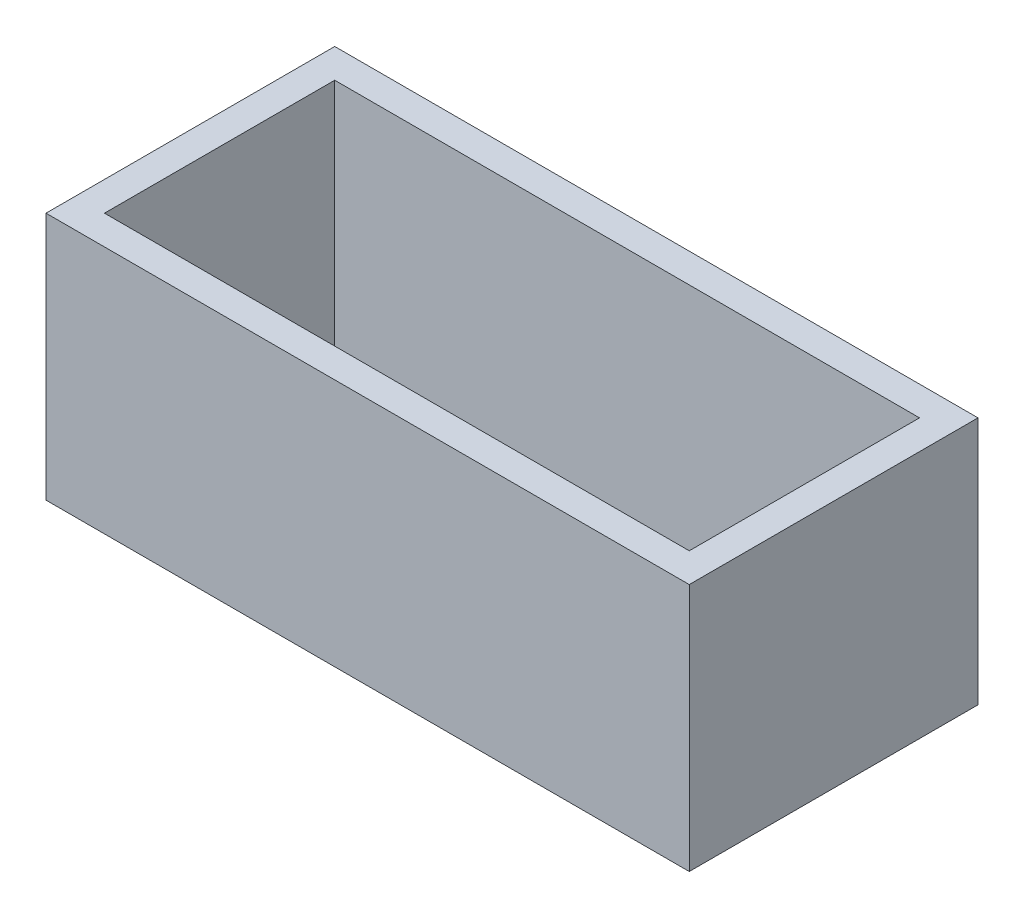
ISO-10303-21;
HEADER;
FILE_DESCRIPTION(('STEP AP214'),'2;1');
FILE_NAME('part.step','',(''),(''),'','','');
FILE_SCHEMA(('AUTOMOTIVE_DESIGN { 1 0 10303 214 1 1 1 1 }'));
ENDSEC;
DATA;
#1=APPLICATION_CONTEXT('core data for automotive mechanical design processes');
#2=APPLICATION_PROTOCOL_DEFINITION('international standard','automotive_design',2000,#1);
#3=PRODUCT_CONTEXT('',#1,'mechanical');
#4=PRODUCT('Part','Part','',(#3));
#5=PRODUCT_RELATED_PRODUCT_CATEGORY('part','',(#4));
#6=PRODUCT_DEFINITION_FORMATION('','',#4);
#7=PRODUCT_DEFINITION_CONTEXT('part definition',#1,'design');
#8=PRODUCT_DEFINITION('design','',#6,#7);
#9=PRODUCT_DEFINITION_SHAPE('','',#8);
#10=(LENGTH_UNIT() NAMED_UNIT(*) SI_UNIT(.MILLI.,.METRE.));
#11=(NAMED_UNIT(*) PLANE_ANGLE_UNIT() SI_UNIT($,.RADIAN.));
#12=(NAMED_UNIT(*) SI_UNIT($,.STERADIAN.) SOLID_ANGLE_UNIT());
#13=UNCERTAINTY_MEASURE_WITH_UNIT(LENGTH_MEASURE(1.E-05),#10,'distance_accuracy_value','');
#14=(GEOMETRIC_REPRESENTATION_CONTEXT(3) GLOBAL_UNCERTAINTY_ASSIGNED_CONTEXT((#13)) GLOBAL_UNIT_ASSIGNED_CONTEXT((#10,
#11,#12)) REPRESENTATION_CONTEXT('',''));
#15=CARTESIAN_POINT('',(0.,0.,0.));
#16=DIRECTION('',(0.,0.,1.));
#17=DIRECTION('',(1.,0.,0.));
#18=AXIS2_PLACEMENT_3D('',#15,#16,#17);
#19=CARTESIAN_POINT('',(0.,17.,0.));
#20=DIRECTION('',(0.,1.,0.));
#21=DIRECTION('',(0.,0.,1.));
#22=AXIS2_PLACEMENT_3D('',#19,#20,#21);
#23=PLANE('',#22);
#24=DIRECTION('',(0.,0.,-1.));
#25=VECTOR('',#24,1.);
#26=CARTESIAN_POINT('',(22.,17.,9.875));
#27=LINE('',#26,#25);
#28=CARTESIAN_POINT('',(22.,17.,9.875));
#29=VERTEX_POINT('',#28);
#30=CARTESIAN_POINT('',(22.,17.,-9.875));
#31=VERTEX_POINT('',#30);
#32=EDGE_CURVE('E134',#29,#31,#27,.T.);
#33=ORIENTED_EDGE('',*,*,#32,.T.);
#34=DIRECTION('',(-1.,0.,0.));
#35=VECTOR('',#34,1.);
#36=CARTESIAN_POINT('',(22.,17.,-9.875));
#37=LINE('',#36,#35);
#38=CARTESIAN_POINT('',(-22.,17.,-9.875));
#39=VERTEX_POINT('',#38);
#40=EDGE_CURVE('E137',#31,#39,#37,.T.);
#41=ORIENTED_EDGE('',*,*,#40,.T.);
#42=DIRECTION('',(0.,0.,1.));
#43=VECTOR('',#42,1.);
#44=CARTESIAN_POINT('',(-22.,17.,9.875));
#45=LINE('',#44,#43);
#46=CARTESIAN_POINT('',(-22.,17.,9.875));
#47=VERTEX_POINT('',#46);
#48=EDGE_CURVE('E140',#39,#47,#45,.T.);
#49=ORIENTED_EDGE('',*,*,#48,.T.);
#50=DIRECTION('',(1.,0.,0.));
#51=VECTOR('',#50,1.);
#52=CARTESIAN_POINT('',(22.,17.,9.875));
#53=LINE('',#52,#51);
#54=EDGE_CURVE('E142',#47,#29,#53,.T.);
#55=ORIENTED_EDGE('',*,*,#54,.T.);
#56=EDGE_LOOP('',(#33,#41,#49,#55));
#57=FACE_BOUND('',#56,.T.);
#58=DIRECTION('',(1.,0.,0.));
#59=VECTOR('',#58,1.);
#60=CARTESIAN_POINT('',(20.,17.,7.875));
#61=LINE('',#60,#59);
#62=CARTESIAN_POINT('',(-20.,17.,7.875));
#63=VERTEX_POINT('',#62);
#64=CARTESIAN_POINT('',(20.,17.,7.875));
#65=VERTEX_POINT('',#64);
#66=EDGE_CURVE('E106',#63,#65,#61,.T.);
#67=ORIENTED_EDGE('',*,*,#66,.F.);
#68=DIRECTION('',(0.,0.,1.));
#69=VECTOR('',#68,1.);
#70=CARTESIAN_POINT('',(-20.,17.,7.875));
#71=LINE('',#70,#69);
#72=CARTESIAN_POINT('',(-20.,17.,-7.875));
#73=VERTEX_POINT('',#72);
#74=EDGE_CURVE('E98',#73,#63,#71,.T.);
#75=ORIENTED_EDGE('',*,*,#74,.F.);
#76=DIRECTION('',(-1.,0.,0.));
#77=VECTOR('',#76,1.);
#78=CARTESIAN_POINT('',(20.,17.,-7.875));
#79=LINE('',#78,#77);
#80=CARTESIAN_POINT('',(20.,17.,-7.875));
#81=VERTEX_POINT('',#80);
#82=EDGE_CURVE('E120',#81,#73,#79,.T.);
#83=ORIENTED_EDGE('',*,*,#82,.F.);
#84=DIRECTION('',(0.,0.,-1.));
#85=VECTOR('',#84,1.);
#86=CARTESIAN_POINT('',(20.,17.,7.875));
#87=LINE('',#86,#85);
#88=EDGE_CURVE('E118',#65,#81,#87,.T.);
#89=ORIENTED_EDGE('',*,*,#88,.F.);
#90=EDGE_LOOP('',(#67,#75,#83,#89));
#91=FACE_BOUND('',#90,.T.);
#92=ADVANCED_FACE('F33',(#57,#91),#23,.T.);
#93=CARTESIAN_POINT('',(0.,0.,0.));
#94=DIRECTION('',(0.,1.,0.));
#95=DIRECTION('',(0.,0.,1.));
#96=AXIS2_PLACEMENT_3D('',#93,#94,#95);
#97=PLANE('',#96);
#98=DIRECTION('',(0.,0.,-1.));
#99=VECTOR('',#98,1.);
#100=CARTESIAN_POINT('',(22.,0.,9.875));
#101=LINE('',#100,#99);
#102=CARTESIAN_POINT('',(22.,0.,9.875));
#103=VERTEX_POINT('',#102);
#104=CARTESIAN_POINT('',(22.,0.,-9.875));
#105=VERTEX_POINT('',#104);
#106=EDGE_CURVE('E114',#103,#105,#101,.T.);
#107=ORIENTED_EDGE('',*,*,#106,.F.);
#108=DIRECTION('',(1.,0.,0.));
#109=VECTOR('',#108,1.);
#110=CARTESIAN_POINT('',(22.,0.,9.875));
#111=LINE('',#110,#109);
#112=CARTESIAN_POINT('',(-22.,0.,9.875));
#113=VERTEX_POINT('',#112);
#114=EDGE_CURVE('E138',#113,#103,#111,.T.);
#115=ORIENTED_EDGE('',*,*,#114,.F.);
#116=DIRECTION('',(0.,0.,1.));
#117=VECTOR('',#116,1.);
#118=CARTESIAN_POINT('',(-22.,0.,9.875));
#119=LINE('',#118,#117);
#120=CARTESIAN_POINT('',(-22.,0.,-9.875));
#121=VERTEX_POINT('',#120);
#122=EDGE_CURVE('E149',#121,#113,#119,.T.);
#123=ORIENTED_EDGE('',*,*,#122,.F.);
#124=DIRECTION('',(-1.,0.,0.));
#125=VECTOR('',#124,1.);
#126=CARTESIAN_POINT('',(22.,0.,-9.875));
#127=LINE('',#126,#125);
#128=EDGE_CURVE('E147',#105,#121,#127,.T.);
#129=ORIENTED_EDGE('',*,*,#128,.F.);
#130=EDGE_LOOP('',(#107,#115,#123,#129));
#131=FACE_BOUND('',#130,.T.);
#132=DIRECTION('',(0.,0.,1.));
#133=VECTOR('',#132,1.);
#134=CARTESIAN_POINT('',(-20.,0.,7.875));
#135=LINE('',#134,#133);
#136=CARTESIAN_POINT('',(-20.,0.,-7.875));
#137=VERTEX_POINT('',#136);
#138=CARTESIAN_POINT('',(-20.,0.,7.875));
#139=VERTEX_POINT('',#138);
#140=EDGE_CURVE('E56',#137,#139,#135,.T.);
#141=ORIENTED_EDGE('',*,*,#140,.T.);
#142=DIRECTION('',(1.,0.,0.));
#143=VECTOR('',#142,1.);
#144=CARTESIAN_POINT('',(20.,0.,7.875));
#145=LINE('',#144,#143);
#146=CARTESIAN_POINT('',(20.,0.,7.875));
#147=VERTEX_POINT('',#146);
#148=EDGE_CURVE('E113',#139,#147,#145,.T.);
#149=ORIENTED_EDGE('',*,*,#148,.T.);
#150=DIRECTION('',(0.,0.,-1.));
#151=VECTOR('',#150,1.);
#152=CARTESIAN_POINT('',(20.,0.,7.875));
#153=LINE('',#152,#151);
#154=CARTESIAN_POINT('',(20.,0.,-7.875));
#155=VERTEX_POINT('',#154);
#156=EDGE_CURVE('E126',#147,#155,#153,.T.);
#157=ORIENTED_EDGE('',*,*,#156,.T.);
#158=DIRECTION('',(-1.,0.,0.));
#159=VECTOR('',#158,1.);
#160=CARTESIAN_POINT('',(20.,0.,-7.875));
#161=LINE('',#160,#159);
#162=EDGE_CURVE('E107',#155,#137,#161,.T.);
#163=ORIENTED_EDGE('',*,*,#162,.T.);
#164=EDGE_LOOP('',(#141,#149,#157,#163));
#165=FACE_BOUND('',#164,.T.);
#166=ADVANCED_FACE('F167',(#131,#165),#97,.F.);
#167=CARTESIAN_POINT('',(22.,17.,9.875));
#168=DIRECTION('',(-1.,0.,0.));
#169=DIRECTION('',(0.,0.,1.));
#170=AXIS2_PLACEMENT_3D('',#167,#168,#169);
#171=PLANE('',#170);
#172=ORIENTED_EDGE('',*,*,#106,.T.);
#173=DIRECTION('',(0.,-1.,0.));
#174=VECTOR('',#173,1.);
#175=CARTESIAN_POINT('',(22.,17.,-9.875));
#176=LINE('',#175,#174);
#177=EDGE_CURVE('E11',#31,#105,#176,.T.);
#178=ORIENTED_EDGE('',*,*,#177,.F.);
#179=ORIENTED_EDGE('',*,*,#32,.F.);
#180=DIRECTION('',(0.,-1.,0.));
#181=VECTOR('',#180,1.);
#182=CARTESIAN_POINT('',(22.,17.,9.875));
#183=LINE('',#182,#181);
#184=EDGE_CURVE('E144',#29,#103,#183,.T.);
#185=ORIENTED_EDGE('',*,*,#184,.T.);
#186=EDGE_LOOP('',(#172,#178,#179,#185));
#187=FACE_BOUND('',#186,.T.);
#188=ADVANCED_FACE('F35',(#187),#171,.F.);
#189=CARTESIAN_POINT('',(22.,17.,-9.875));
#190=DIRECTION('',(0.,0.,1.));
#191=DIRECTION('',(1.,0.,0.));
#192=AXIS2_PLACEMENT_3D('',#189,#190,#191);
#193=PLANE('',#192);
#194=ORIENTED_EDGE('',*,*,#128,.T.);
#195=DIRECTION('',(0.,-1.,0.));
#196=VECTOR('',#195,1.);
#197=CARTESIAN_POINT('',(-22.,17.,-9.875));
#198=LINE('',#197,#196);
#199=EDGE_CURVE('E41',#39,#121,#198,.T.);
#200=ORIENTED_EDGE('',*,*,#199,.F.);
#201=ORIENTED_EDGE('',*,*,#40,.F.);
#202=ORIENTED_EDGE('',*,*,#177,.T.);
#203=EDGE_LOOP('',(#194,#200,#201,#202));
#204=FACE_BOUND('',#203,.T.);
#205=ADVANCED_FACE('F177',(#204),#193,.F.);
#206=CARTESIAN_POINT('',(-22.,17.,9.875));
#207=DIRECTION('',(1.,0.,0.));
#208=DIRECTION('',(0.,0.,-1.));
#209=AXIS2_PLACEMENT_3D('',#206,#207,#208);
#210=PLANE('',#209);
#211=ORIENTED_EDGE('',*,*,#122,.T.);
#212=DIRECTION('',(0.,-1.,0.));
#213=VECTOR('',#212,1.);
#214=CARTESIAN_POINT('',(-22.,17.,9.875));
#215=LINE('',#214,#213);
#216=EDGE_CURVE('E154',#47,#113,#215,.T.);
#217=ORIENTED_EDGE('',*,*,#216,.F.);
#218=ORIENTED_EDGE('',*,*,#48,.F.);
#219=ORIENTED_EDGE('',*,*,#199,.T.);
#220=EDGE_LOOP('',(#211,#217,#218,#219));
#221=FACE_BOUND('',#220,.T.);
#222=ADVANCED_FACE('F161',(#221),#210,.F.);
#223=CARTESIAN_POINT('',(22.,17.,9.875));
#224=DIRECTION('',(0.,0.,-1.));
#225=DIRECTION('',(-1.,0.,0.));
#226=AXIS2_PLACEMENT_3D('',#223,#224,#225);
#227=PLANE('',#226);
#228=ORIENTED_EDGE('',*,*,#114,.T.);
#229=ORIENTED_EDGE('',*,*,#184,.F.);
#230=ORIENTED_EDGE('',*,*,#54,.F.);
#231=ORIENTED_EDGE('',*,*,#216,.T.);
#232=EDGE_LOOP('',(#228,#229,#230,#231));
#233=FACE_BOUND('',#232,.T.);
#234=ADVANCED_FACE('F171',(#233),#227,.F.);
#235=CARTESIAN_POINT('',(-20.,17.,7.875));
#236=DIRECTION('',(1.,0.,0.));
#237=DIRECTION('',(0.,0.,-1.));
#238=AXIS2_PLACEMENT_3D('',#235,#236,#237);
#239=PLANE('',#238);
#240=ORIENTED_EDGE('',*,*,#140,.F.);
#241=DIRECTION('',(0.,-1.,0.));
#242=VECTOR('',#241,1.);
#243=CARTESIAN_POINT('',(-20.,17.,-7.875));
#244=LINE('',#243,#242);
#245=EDGE_CURVE('E102',#73,#137,#244,.T.);
#246=ORIENTED_EDGE('',*,*,#245,.F.);
#247=ORIENTED_EDGE('',*,*,#74,.T.);
#248=DIRECTION('',(0.,-1.,0.));
#249=VECTOR('',#248,1.);
#250=CARTESIAN_POINT('',(-20.,17.,7.875));
#251=LINE('',#250,#249);
#252=EDGE_CURVE('E101',#63,#139,#251,.T.);
#253=ORIENTED_EDGE('',*,*,#252,.T.);
#254=EDGE_LOOP('',(#240,#246,#247,#253));
#255=FACE_BOUND('',#254,.T.);
#256=ADVANCED_FACE('F100',(#255),#239,.T.);
#257=CARTESIAN_POINT('',(20.,17.,7.875));
#258=DIRECTION('',(0.,0.,-1.));
#259=DIRECTION('',(-1.,0.,0.));
#260=AXIS2_PLACEMENT_3D('',#257,#258,#259);
#261=PLANE('',#260);
#262=ORIENTED_EDGE('',*,*,#148,.F.);
#263=ORIENTED_EDGE('',*,*,#252,.F.);
#264=ORIENTED_EDGE('',*,*,#66,.T.);
#265=DIRECTION('',(0.,-1.,0.));
#266=VECTOR('',#265,1.);
#267=CARTESIAN_POINT('',(20.,17.,7.875));
#268=LINE('',#267,#266);
#269=EDGE_CURVE('E115',#65,#147,#268,.T.);
#270=ORIENTED_EDGE('',*,*,#269,.T.);
#271=EDGE_LOOP('',(#262,#263,#264,#270));
#272=FACE_BOUND('',#271,.T.);
#273=ADVANCED_FACE('F110',(#272),#261,.T.);
#274=CARTESIAN_POINT('',(20.,17.,7.875));
#275=DIRECTION('',(-1.,0.,0.));
#276=DIRECTION('',(0.,0.,1.));
#277=AXIS2_PLACEMENT_3D('',#274,#275,#276);
#278=PLANE('',#277);
#279=ORIENTED_EDGE('',*,*,#156,.F.);
#280=ORIENTED_EDGE('',*,*,#269,.F.);
#281=ORIENTED_EDGE('',*,*,#88,.T.);
#282=DIRECTION('',(0.,-1.,0.));
#283=VECTOR('',#282,1.);
#284=CARTESIAN_POINT('',(20.,17.,-7.875));
#285=LINE('',#284,#283);
#286=EDGE_CURVE('E48',#81,#155,#285,.T.);
#287=ORIENTED_EDGE('',*,*,#286,.T.);
#288=EDGE_LOOP('',(#279,#280,#281,#287));
#289=FACE_BOUND('',#288,.T.);
#290=ADVANCED_FACE('F200',(#289),#278,.T.);
#291=CARTESIAN_POINT('',(20.,17.,-7.875));
#292=DIRECTION('',(0.,0.,1.));
#293=DIRECTION('',(1.,0.,0.));
#294=AXIS2_PLACEMENT_3D('',#291,#292,#293);
#295=PLANE('',#294);
#296=ORIENTED_EDGE('',*,*,#162,.F.);
#297=ORIENTED_EDGE('',*,*,#286,.F.);
#298=ORIENTED_EDGE('',*,*,#82,.T.);
#299=ORIENTED_EDGE('',*,*,#245,.T.);
#300=EDGE_LOOP('',(#296,#297,#298,#299));
#301=FACE_BOUND('',#300,.T.);
#302=ADVANCED_FACE('F204',(#301),#295,.T.);
#303=CLOSED_SHELL('',(#92,#166,#188,#205,#222,#234,#256,#273,#290,#302));
#304=MANIFOLD_SOLID_BREP('B2',#303);
#305=ADVANCED_BREP_SHAPE_REPRESENTATION('',(#18,#304),#14);
#306=SHAPE_DEFINITION_REPRESENTATION(#9,#305);
ENDSEC;
END-ISO-10303-21;
